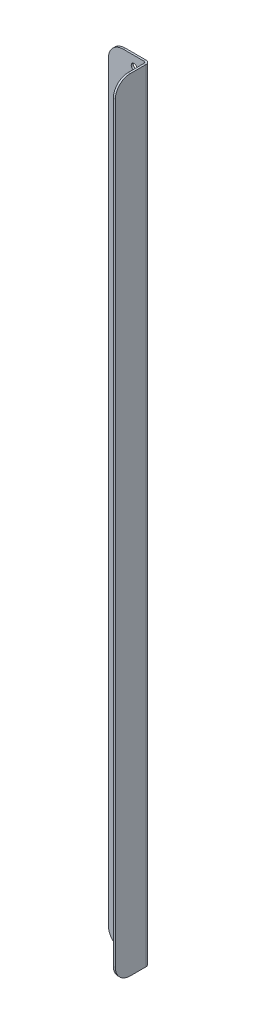
ISO-10303-21;
HEADER;
FILE_DESCRIPTION(('STEP AP214'),'2;1');
FILE_NAME('part.step','',(''),(''),'','','');
FILE_SCHEMA(('AUTOMOTIVE_DESIGN { 1 0 10303 214 1 1 1 1 }'));
ENDSEC;
DATA;
#1=APPLICATION_CONTEXT('core data for automotive mechanical design processes');
#2=APPLICATION_PROTOCOL_DEFINITION('international standard','automotive_design',2000,#1);
#3=PRODUCT_CONTEXT('',#1,'mechanical');
#4=PRODUCT('Part','Part','',(#3));
#5=PRODUCT_RELATED_PRODUCT_CATEGORY('part','',(#4));
#6=PRODUCT_DEFINITION_FORMATION('','',#4);
#7=PRODUCT_DEFINITION_CONTEXT('part definition',#1,'design');
#8=PRODUCT_DEFINITION('design','',#6,#7);
#9=PRODUCT_DEFINITION_SHAPE('','',#8);
#10=(LENGTH_UNIT() NAMED_UNIT(*) SI_UNIT(.MILLI.,.METRE.));
#11=(NAMED_UNIT(*) PLANE_ANGLE_UNIT() SI_UNIT($,.RADIAN.));
#12=(NAMED_UNIT(*) SI_UNIT($,.STERADIAN.) SOLID_ANGLE_UNIT());
#13=UNCERTAINTY_MEASURE_WITH_UNIT(LENGTH_MEASURE(1.E-05),#10,'distance_accuracy_value','');
#14=(GEOMETRIC_REPRESENTATION_CONTEXT(3) GLOBAL_UNCERTAINTY_ASSIGNED_CONTEXT((#13)) GLOBAL_UNIT_ASSIGNED_CONTEXT((#10,
#11,#12)) REPRESENTATION_CONTEXT('',''));
#15=CARTESIAN_POINT('',(0.,0.,0.));
#16=DIRECTION('',(0.,0.,1.));
#17=DIRECTION('',(1.,0.,0.));
#18=AXIS2_PLACEMENT_3D('',#15,#16,#17);
#19=CARTESIAN_POINT('',(6.00749999999836,386.,0.));
#20=DIRECTION('',(0.,0.,1.));
#21=DIRECTION('',(1.,0.,0.));
#22=AXIS2_PLACEMENT_3D('',#19,#20,#21);
#23=CYLINDRICAL_SURFACE('',#22,2.9);
#24=CARTESIAN_POINT('',(6.00749999999836,386.,-2.00000000000001));
#25=DIRECTION('',(0.,0.,1.));
#26=DIRECTION('',(1.,0.,0.));
#27=AXIS2_PLACEMENT_3D('',#24,#25,#26);
#28=CIRCLE('',#27,2.9);
#29=CARTESIAN_POINT('',(8.90749999999836,386.,-2.00000000000001));
#30=VERTEX_POINT('',#29);
#31=EDGE_CURVE('E278',#30,#30,#28,.T.);
#32=ORIENTED_EDGE('',*,*,#31,.F.);
#33=EDGE_LOOP('',(#32));
#34=FACE_BOUND('',#33,.T.);
#35=CARTESIAN_POINT('',(6.00749999999836,386.,0.));
#36=DIRECTION('',(0.,0.,1.));
#37=DIRECTION('',(1.,0.,0.));
#38=AXIS2_PLACEMENT_3D('',#35,#36,#37);
#39=CIRCLE('',#38,2.9);
#40=CARTESIAN_POINT('',(8.90749999999836,386.,0.));
#41=VERTEX_POINT('',#40);
#42=EDGE_CURVE('E282',#41,#41,#39,.T.);
#43=ORIENTED_EDGE('',*,*,#42,.T.);
#44=EDGE_LOOP('',(#43));
#45=FACE_BOUND('',#44,.T.);
#46=ADVANCED_FACE('F62',(#34,#45),#23,.F.);
#47=CARTESIAN_POINT('',(6.00749999999836,193.,0.));
#48=DIRECTION('',(0.,0.,1.));
#49=DIRECTION('',(1.,0.,0.));
#50=AXIS2_PLACEMENT_3D('',#47,#48,#49);
#51=CYLINDRICAL_SURFACE('',#50,2.9);
#52=CARTESIAN_POINT('',(6.00749999999836,193.,-2.00000000000001));
#53=DIRECTION('',(0.,0.,1.));
#54=DIRECTION('',(1.,0.,0.));
#55=AXIS2_PLACEMENT_3D('',#52,#53,#54);
#56=CIRCLE('',#55,2.9);
#57=CARTESIAN_POINT('',(8.90749999999836,193.,-2.00000000000001));
#58=VERTEX_POINT('',#57);
#59=EDGE_CURVE('E270',#58,#58,#56,.T.);
#60=ORIENTED_EDGE('',*,*,#59,.F.);
#61=EDGE_LOOP('',(#60));
#62=FACE_BOUND('',#61,.T.);
#63=CARTESIAN_POINT('',(6.00749999999836,193.,0.));
#64=DIRECTION('',(0.,0.,1.));
#65=DIRECTION('',(1.,0.,0.));
#66=AXIS2_PLACEMENT_3D('',#63,#64,#65);
#67=CIRCLE('',#66,2.9);
#68=CARTESIAN_POINT('',(8.90749999999836,193.,0.));
#69=VERTEX_POINT('',#68);
#70=EDGE_CURVE('E274',#69,#69,#67,.T.);
#71=ORIENTED_EDGE('',*,*,#70,.T.);
#72=EDGE_LOOP('',(#71));
#73=FACE_BOUND('',#72,.T.);
#74=ADVANCED_FACE('F422',(#62,#73),#51,.F.);
#75=CARTESIAN_POINT('',(6.00749999999836,0.,0.));
#76=DIRECTION('',(0.,0.,1.));
#77=DIRECTION('',(1.,0.,0.));
#78=AXIS2_PLACEMENT_3D('',#75,#76,#77);
#79=CYLINDRICAL_SURFACE('',#78,2.9);
#80=CARTESIAN_POINT('',(6.00749999999836,0.,-2.00000000000001));
#81=DIRECTION('',(0.,0.,1.));
#82=DIRECTION('',(1.,0.,0.));
#83=AXIS2_PLACEMENT_3D('',#80,#81,#82);
#84=CIRCLE('',#83,2.9);
#85=CARTESIAN_POINT('',(8.90749999999836,0.,-2.00000000000001));
#86=VERTEX_POINT('',#85);
#87=EDGE_CURVE('E253',#86,#86,#84,.T.);
#88=ORIENTED_EDGE('',*,*,#87,.F.);
#89=EDGE_LOOP('',(#88));
#90=FACE_BOUND('',#89,.T.);
#91=CARTESIAN_POINT('',(6.00749999999836,0.,0.));
#92=DIRECTION('',(0.,0.,1.));
#93=DIRECTION('',(1.,0.,0.));
#94=AXIS2_PLACEMENT_3D('',#91,#92,#93);
#95=CIRCLE('',#94,2.9);
#96=CARTESIAN_POINT('',(8.90749999999836,0.,0.));
#97=VERTEX_POINT('',#96);
#98=EDGE_CURVE('E266',#97,#97,#95,.T.);
#99=ORIENTED_EDGE('',*,*,#98,.T.);
#100=EDGE_LOOP('',(#99));
#101=FACE_BOUND('',#100,.T.);
#102=ADVANCED_FACE('F428',(#90,#101),#79,.F.);
#103=CARTESIAN_POINT('',(-20.,396.,-2.));
#104=DIRECTION('',(0.,1.,0.));
#105=DIRECTION('',(0.,0.,1.));
#106=AXIS2_PLACEMENT_3D('',#103,#104,#105);
#107=PLANE('',#106);
#108=DIRECTION('',(-1.,0.,0.));
#109=VECTOR('',#108,1.);
#110=CARTESIAN_POINT('',(-20.,396.,-2.));
#111=LINE('',#110,#109);
#112=CARTESIAN_POINT('',(16.,396.,-2.00000000000001));
#113=VERTEX_POINT('',#112);
#114=CARTESIAN_POINT('',(-5.,396.,-2.));
#115=VERTEX_POINT('',#114);
#116=EDGE_CURVE('E242',#113,#115,#111,.T.);
#117=ORIENTED_EDGE('',*,*,#116,.T.);
#118=DIRECTION('',(0.,0.,1.));
#119=VECTOR('',#118,1.);
#120=CARTESIAN_POINT('',(-5.,396.,-2.));
#121=LINE('',#120,#119);
#122=CARTESIAN_POINT('',(-5.,396.,0.));
#123=VERTEX_POINT('',#122);
#124=EDGE_CURVE('E307',#115,#123,#121,.T.);
#125=ORIENTED_EDGE('',*,*,#124,.T.);
#126=DIRECTION('',(-1.,0.,0.));
#127=VECTOR('',#126,1.);
#128=CARTESIAN_POINT('',(-20.,396.,0.));
#129=LINE('',#128,#127);
#130=CARTESIAN_POINT('',(16.,396.,0.));
#131=VERTEX_POINT('',#130);
#132=EDGE_CURVE('E239',#131,#123,#129,.T.);
#133=ORIENTED_EDGE('',*,*,#132,.F.);
#134=DIRECTION('',(0.,0.,-1.));
#135=VECTOR('',#134,1.);
#136=CARTESIAN_POINT('',(16.,396.,0.));
#137=LINE('',#136,#135);
#138=EDGE_CURVE('E224',#131,#113,#137,.T.);
#139=ORIENTED_EDGE('',*,*,#138,.T.);
#140=EDGE_LOOP('',(#117,#125,#133,#139));
#141=FACE_BOUND('',#140,.T.);
#142=ADVANCED_FACE('F374',(#141),#107,.T.);
#143=CARTESIAN_POINT('',(0.,0.,-2.));
#144=DIRECTION('',(0.,0.,-1.));
#145=DIRECTION('',(-1.,0.,0.));
#146=AXIS2_PLACEMENT_3D('',#143,#144,#145);
#147=PLANE('',#146);
#148=CARTESIAN_POINT('',(6.00749999999836,-193.,-2.00000000000001));
#149=DIRECTION('',(0.,0.,1.));
#150=DIRECTION('',(1.,0.,0.));
#151=AXIS2_PLACEMENT_3D('',#148,#149,#150);
#152=CIRCLE('',#151,2.9);
#153=CARTESIAN_POINT('',(8.90749999999836,-193.,-2.00000000000001));
#154=VERTEX_POINT('',#153);
#155=EDGE_CURVE('E695',#154,#154,#152,.T.);
#156=ORIENTED_EDGE('',*,*,#155,.T.);
#157=EDGE_LOOP('',(#156));
#158=FACE_BOUND('',#157,.T.);
#159=CARTESIAN_POINT('',(6.00749999999836,-386.,-2.00000000000001));
#160=DIRECTION('',(0.,0.,1.));
#161=DIRECTION('',(1.,0.,0.));
#162=AXIS2_PLACEMENT_3D('',#159,#160,#161);
#163=CIRCLE('',#162,2.9);
#164=CARTESIAN_POINT('',(8.90749999999836,-386.,-2.00000000000001));
#165=VERTEX_POINT('',#164);
#166=EDGE_CURVE('E219',#165,#165,#163,.T.);
#167=ORIENTED_EDGE('',*,*,#166,.T.);
#168=EDGE_LOOP('',(#167));
#169=FACE_BOUND('',#168,.T.);
#170=DIRECTION('',(0.,-1.,0.));
#171=VECTOR('',#170,1.);
#172=CARTESIAN_POINT('',(-20.,-396.,-2.));
#173=LINE('',#172,#171);
#174=CARTESIAN_POINT('',(-20.,381.,-2.));
#175=VERTEX_POINT('',#174);
#176=CARTESIAN_POINT('',(-20.,-381.,-2.));
#177=VERTEX_POINT('',#176);
#178=EDGE_CURVE('E246',#175,#177,#173,.T.);
#179=ORIENTED_EDGE('',*,*,#178,.F.);
#180=CARTESIAN_POINT('',(-5.,381.,-2.));
#181=DIRECTION('',(0.,0.,-1.));
#182=DIRECTION('',(-1.,0.,0.));
#183=AXIS2_PLACEMENT_3D('',#180,#181,#182);
#184=CIRCLE('',#183,15.);
#185=EDGE_CURVE('E326',#175,#115,#184,.T.);
#186=ORIENTED_EDGE('',*,*,#185,.T.);
#187=ORIENTED_EDGE('',*,*,#116,.F.);
#188=DIRECTION('',(0.,1.,0.));
#189=VECTOR('',#188,1.);
#190=CARTESIAN_POINT('',(16.,396.,-2.00000000000001));
#191=LINE('',#190,#189);
#192=CARTESIAN_POINT('',(16.,-396.,-2.));
#193=VERTEX_POINT('',#192);
#194=EDGE_CURVE('E161',#113,#193,#191,.F.);
#195=ORIENTED_EDGE('',*,*,#194,.T.);
#196=DIRECTION('',(1.,0.,0.));
#197=VECTOR('',#196,1.);
#198=CARTESIAN_POINT('',(-20.,-396.,-2.));
#199=LINE('',#198,#197);
#200=CARTESIAN_POINT('',(-5.,-396.,-2.));
#201=VERTEX_POINT('',#200);
#202=EDGE_CURVE('E250',#201,#193,#199,.T.);
#203=ORIENTED_EDGE('',*,*,#202,.F.);
#204=CARTESIAN_POINT('',(-5.,-381.,-2.));
#205=DIRECTION('',(0.,0.,-1.));
#206=DIRECTION('',(-1.,0.,0.));
#207=AXIS2_PLACEMENT_3D('',#204,#205,#206);
#208=CIRCLE('',#207,15.);
#209=EDGE_CURVE('E84',#201,#177,#208,.T.);
#210=ORIENTED_EDGE('',*,*,#209,.T.);
#211=EDGE_LOOP('',(#179,#186,#187,#195,#203,#210));
#212=FACE_BOUND('',#211,.T.);
#213=ORIENTED_EDGE('',*,*,#87,.T.);
#214=EDGE_LOOP('',(#213));
#215=FACE_BOUND('',#214,.T.);
#216=ORIENTED_EDGE('',*,*,#59,.T.);
#217=EDGE_LOOP('',(#216));
#218=FACE_BOUND('',#217,.T.);
#219=ORIENTED_EDGE('',*,*,#31,.T.);
#220=EDGE_LOOP('',(#219));
#221=FACE_BOUND('',#220,.T.);
#222=ADVANCED_FACE('F368',(#158,#169,#212,#215,#218,#221),#147,.T.);
#223=CARTESIAN_POINT('',(0.,0.,0.));
#224=DIRECTION('',(0.,0.,-1.));
#225=DIRECTION('',(-1.,0.,0.));
#226=AXIS2_PLACEMENT_3D('',#223,#224,#225);
#227=PLANE('',#226);
#228=CARTESIAN_POINT('',(6.00749999999836,-193.,0.));
#229=DIRECTION('',(0.,0.,1.));
#230=DIRECTION('',(1.,0.,0.));
#231=AXIS2_PLACEMENT_3D('',#228,#229,#230);
#232=CIRCLE('',#231,2.9);
#233=CARTESIAN_POINT('',(8.90749999999836,-193.,0.));
#234=VERTEX_POINT('',#233);
#235=EDGE_CURVE('E703',#234,#234,#232,.T.);
#236=ORIENTED_EDGE('',*,*,#235,.F.);
#237=EDGE_LOOP('',(#236));
#238=FACE_BOUND('',#237,.T.);
#239=CARTESIAN_POINT('',(6.00749999999836,-386.,0.));
#240=DIRECTION('',(0.,0.,1.));
#241=DIRECTION('',(1.,0.,0.));
#242=AXIS2_PLACEMENT_3D('',#239,#240,#241);
#243=CIRCLE('',#242,2.9);
#244=CARTESIAN_POINT('',(8.90749999999836,-386.,0.));
#245=VERTEX_POINT('',#244);
#246=EDGE_CURVE('E699',#245,#245,#243,.T.);
#247=ORIENTED_EDGE('',*,*,#246,.F.);
#248=EDGE_LOOP('',(#247));
#249=FACE_BOUND('',#248,.T.);
#250=ORIENTED_EDGE('',*,*,#132,.T.);
#251=CARTESIAN_POINT('',(-5.,381.,0.));
#252=DIRECTION('',(0.,0.,-1.));
#253=DIRECTION('',(-1.,0.,0.));
#254=AXIS2_PLACEMENT_3D('',#251,#252,#253);
#255=CIRCLE('',#254,15.);
#256=CARTESIAN_POINT('',(-20.,381.,0.));
#257=VERTEX_POINT('',#256);
#258=EDGE_CURVE('E314',#123,#257,#255,.F.);
#259=ORIENTED_EDGE('',*,*,#258,.T.);
#260=DIRECTION('',(0.,-1.,0.));
#261=VECTOR('',#260,1.);
#262=CARTESIAN_POINT('',(-20.,-396.,0.));
#263=LINE('',#262,#261);
#264=CARTESIAN_POINT('',(-20.,-381.,0.));
#265=VERTEX_POINT('',#264);
#266=EDGE_CURVE('E257',#257,#265,#263,.T.);
#267=ORIENTED_EDGE('',*,*,#266,.T.);
#268=CARTESIAN_POINT('',(-5.,-381.,0.));
#269=DIRECTION('',(0.,0.,-1.));
#270=DIRECTION('',(-1.,0.,0.));
#271=AXIS2_PLACEMENT_3D('',#268,#269,#270);
#272=CIRCLE('',#271,15.);
#273=CARTESIAN_POINT('',(-5.,-396.,0.));
#274=VERTEX_POINT('',#273);
#275=EDGE_CURVE('E311',#265,#274,#272,.F.);
#276=ORIENTED_EDGE('',*,*,#275,.T.);
#277=DIRECTION('',(1.,0.,0.));
#278=VECTOR('',#277,1.);
#279=CARTESIAN_POINT('',(-20.,-396.,0.));
#280=LINE('',#279,#278);
#281=CARTESIAN_POINT('',(16.,-396.,0.));
#282=VERTEX_POINT('',#281);
#283=EDGE_CURVE('E247',#274,#282,#280,.T.);
#284=ORIENTED_EDGE('',*,*,#283,.T.);
#285=DIRECTION('',(0.,1.,0.));
#286=VECTOR('',#285,1.);
#287=CARTESIAN_POINT('',(16.,396.,0.));
#288=LINE('',#287,#286);
#289=EDGE_CURVE('E229',#131,#282,#288,.F.);
#290=ORIENTED_EDGE('',*,*,#289,.F.);
#291=EDGE_LOOP('',(#250,#259,#267,#276,#284,#290));
#292=FACE_BOUND('',#291,.T.);
#293=ORIENTED_EDGE('',*,*,#98,.F.);
#294=EDGE_LOOP('',(#293));
#295=FACE_BOUND('',#294,.T.);
#296=ORIENTED_EDGE('',*,*,#70,.F.);
#297=EDGE_LOOP('',(#296));
#298=FACE_BOUND('',#297,.T.);
#299=ORIENTED_EDGE('',*,*,#42,.F.);
#300=EDGE_LOOP('',(#299));
#301=FACE_BOUND('',#300,.T.);
#302=ADVANCED_FACE('F379',(#238,#249,#292,#295,#298,#301),#227,.F.);
#303=CARTESIAN_POINT('',(-20.,-396.,-2.));
#304=DIRECTION('',(0.,-1.,0.));
#305=DIRECTION('',(0.,0.,-1.));
#306=AXIS2_PLACEMENT_3D('',#303,#304,#305);
#307=PLANE('',#306);
#308=ORIENTED_EDGE('',*,*,#283,.F.);
#309=DIRECTION('',(0.,0.,1.));
#310=VECTOR('',#309,1.);
#311=CARTESIAN_POINT('',(-5.,-396.,-2.));
#312=LINE('',#311,#310);
#313=EDGE_CURVE('E71',#274,#201,#312,.F.);
#314=ORIENTED_EDGE('',*,*,#313,.T.);
#315=ORIENTED_EDGE('',*,*,#202,.T.);
#316=DIRECTION('',(0.,0.,-1.));
#317=VECTOR('',#316,1.);
#318=CARTESIAN_POINT('',(16.,-396.,0.));
#319=LINE('',#318,#317);
#320=EDGE_CURVE('E235',#282,#193,#319,.T.);
#321=ORIENTED_EDGE('',*,*,#320,.F.);
#322=EDGE_LOOP('',(#308,#314,#315,#321));
#323=FACE_BOUND('',#322,.T.);
#324=ADVANCED_FACE('F388',(#323),#307,.T.);
#325=CARTESIAN_POINT('',(-20.,-396.,-2.));
#326=DIRECTION('',(-1.,0.,0.));
#327=DIRECTION('',(0.,0.,1.));
#328=AXIS2_PLACEMENT_3D('',#325,#326,#327);
#329=PLANE('',#328);
#330=ORIENTED_EDGE('',*,*,#266,.F.);
#331=DIRECTION('',(0.,0.,1.));
#332=VECTOR('',#331,1.);
#333=CARTESIAN_POINT('',(-20.,381.,-2.));
#334=LINE('',#333,#332);
#335=EDGE_CURVE('E321',#257,#175,#334,.F.);
#336=ORIENTED_EDGE('',*,*,#335,.T.);
#337=ORIENTED_EDGE('',*,*,#178,.T.);
#338=DIRECTION('',(0.,0.,1.));
#339=VECTOR('',#338,1.);
#340=CARTESIAN_POINT('',(-20.,-381.,-2.));
#341=LINE('',#340,#339);
#342=EDGE_CURVE('E317',#177,#265,#341,.T.);
#343=ORIENTED_EDGE('',*,*,#342,.T.);
#344=EDGE_LOOP('',(#330,#336,#337,#343));
#345=FACE_BOUND('',#344,.T.);
#346=ADVANCED_FACE('F383',(#345),#329,.T.);
#347=CARTESIAN_POINT('',(16.,-396.,1.99999999999999));
#348=DIRECTION('',(0.,-1.,0.));
#349=DIRECTION('',(0.,0.,-1.));
#350=AXIS2_PLACEMENT_3D('',#347,#348,#349);
#351=PLANE('',#350);
#352=DIRECTION('',(-1.,0.,0.));
#353=VECTOR('',#352,1.);
#354=CARTESIAN_POINT('',(20.,-396.,1.99999999999999));
#355=LINE('',#354,#353);
#356=CARTESIAN_POINT('',(18.,-396.,1.99999999999999));
#357=VERTEX_POINT('',#356);
#358=CARTESIAN_POINT('',(20.,-396.,1.99999999999998));
#359=VERTEX_POINT('',#358);
#360=EDGE_CURVE('E215',#357,#359,#355,.F.);
#361=ORIENTED_EDGE('',*,*,#360,.F.);
#362=CARTESIAN_POINT('',(16.,-396.,1.99999999999999));
#363=DIRECTION('',(0.,1.,0.));
#364=DIRECTION('',(0.,0.,1.));
#365=AXIS2_PLACEMENT_3D('',#362,#363,#364);
#366=CIRCLE('',#365,2.);
#367=EDGE_CURVE('E165',#282,#357,#366,.F.);
#368=ORIENTED_EDGE('',*,*,#367,.F.);
#369=ORIENTED_EDGE('',*,*,#320,.T.);
#370=CARTESIAN_POINT('',(16.,-396.,1.99999999999999));
#371=DIRECTION('',(0.,1.,0.));
#372=DIRECTION('',(0.,0.,1.));
#373=AXIS2_PLACEMENT_3D('',#370,#371,#372);
#374=CIRCLE('',#373,4.);
#375=EDGE_CURVE('E222',#193,#359,#374,.F.);
#376=ORIENTED_EDGE('',*,*,#375,.T.);
#377=EDGE_LOOP('',(#361,#368,#369,#376));
#378=FACE_BOUND('',#377,.T.);
#379=ADVANCED_FACE('F392',(#378),#351,.T.);
#380=CARTESIAN_POINT('',(16.,396.,1.99999999999999));
#381=DIRECTION('',(0.,-1.,0.));
#382=DIRECTION('',(0.,0.,-1.));
#383=AXIS2_PLACEMENT_3D('',#380,#381,#382);
#384=PLANE('',#383);
#385=CARTESIAN_POINT('',(16.,396.,1.99999999999999));
#386=DIRECTION('',(0.,1.,0.));
#387=DIRECTION('',(0.,0.,1.));
#388=AXIS2_PLACEMENT_3D('',#385,#386,#387);
#389=CIRCLE('',#388,2.);
#390=CARTESIAN_POINT('',(18.,396.,1.99999999999999));
#391=VERTEX_POINT('',#390);
#392=EDGE_CURVE('E172',#391,#131,#389,.T.);
#393=ORIENTED_EDGE('',*,*,#392,.F.);
#394=DIRECTION('',(-1.,0.,0.));
#395=VECTOR('',#394,1.);
#396=CARTESIAN_POINT('',(18.,396.,1.99999999999998));
#397=LINE('',#396,#395);
#398=CARTESIAN_POINT('',(20.,396.,1.99999999999997));
#399=VERTEX_POINT('',#398);
#400=EDGE_CURVE('E169',#391,#399,#397,.F.);
#401=ORIENTED_EDGE('',*,*,#400,.T.);
#402=CARTESIAN_POINT('',(16.,396.,1.99999999999999));
#403=DIRECTION('',(0.,1.,0.));
#404=DIRECTION('',(0.,0.,1.));
#405=AXIS2_PLACEMENT_3D('',#402,#403,#404);
#406=CIRCLE('',#405,4.);
#407=EDGE_CURVE('E153',#399,#113,#406,.T.);
#408=ORIENTED_EDGE('',*,*,#407,.T.);
#409=ORIENTED_EDGE('',*,*,#138,.F.);
#410=EDGE_LOOP('',(#393,#401,#408,#409));
#411=FACE_BOUND('',#410,.T.);
#412=ADVANCED_FACE('F170',(#411),#384,.F.);
#413=CARTESIAN_POINT('',(16.,396.,1.99999999999999));
#414=DIRECTION('',(0.,1.,0.));
#415=DIRECTION('',(1.,0.,0.));
#416=AXIS2_PLACEMENT_3D('',#413,#414,#415);
#417=CYLINDRICAL_SURFACE('',#416,4.);
#418=ORIENTED_EDGE('',*,*,#194,.F.);
#419=ORIENTED_EDGE('',*,*,#407,.F.);
#420=DIRECTION('',(0.,1.,0.));
#421=VECTOR('',#420,1.);
#422=CARTESIAN_POINT('',(20.,-396.,1.99999999999999));
#423=LINE('',#422,#421);
#424=EDGE_CURVE('E158',#399,#359,#423,.F.);
#425=ORIENTED_EDGE('',*,*,#424,.T.);
#426=ORIENTED_EDGE('',*,*,#375,.F.);
#427=EDGE_LOOP('',(#418,#419,#425,#426));
#428=FACE_BOUND('',#427,.T.);
#429=ADVANCED_FACE('F155',(#428),#417,.T.);
#430=CARTESIAN_POINT('',(16.,396.,1.99999999999999));
#431=DIRECTION('',(0.,1.,0.));
#432=DIRECTION('',(1.,0.,0.));
#433=AXIS2_PLACEMENT_3D('',#430,#431,#432);
#434=CYLINDRICAL_SURFACE('',#433,2.);
#435=ORIENTED_EDGE('',*,*,#289,.T.);
#436=ORIENTED_EDGE('',*,*,#367,.T.);
#437=DIRECTION('',(0.,1.,0.));
#438=VECTOR('',#437,1.);
#439=CARTESIAN_POINT('',(18.,-396.,1.99999999999999));
#440=LINE('',#439,#438);
#441=EDGE_CURVE('E178',#357,#391,#440,.T.);
#442=ORIENTED_EDGE('',*,*,#441,.T.);
#443=ORIENTED_EDGE('',*,*,#392,.T.);
#444=EDGE_LOOP('',(#435,#436,#442,#443));
#445=FACE_BOUND('',#444,.T.);
#446=ADVANCED_FACE('F395',(#445),#434,.F.);
#447=CARTESIAN_POINT('',(20.,-396.,0.));
#448=DIRECTION('',(0.,1.,0.));
#449=DIRECTION('',(0.,0.,1.));
#450=AXIS2_PLACEMENT_3D('',#447,#448,#449);
#451=PLANE('',#450);
#452=DIRECTION('',(0.,0.,-1.));
#453=VECTOR('',#452,1.);
#454=CARTESIAN_POINT('',(20.,-396.,0.));
#455=LINE('',#454,#453);
#456=CARTESIAN_POINT('',(20.0000000000001,-396.,18.));
#457=VERTEX_POINT('',#456);
#458=EDGE_CURVE('E186',#457,#359,#455,.T.);
#459=ORIENTED_EDGE('',*,*,#458,.F.);
#460=DIRECTION('',(-1.,0.,0.));
#461=VECTOR('',#460,1.);
#462=CARTESIAN_POINT('',(20.0000000000001,-396.,18.));
#463=LINE('',#462,#461);
#464=CARTESIAN_POINT('',(18.0000000000001,-396.,18.));
#465=VERTEX_POINT('',#464);
#466=EDGE_CURVE('E13',#457,#465,#463,.T.);
#467=ORIENTED_EDGE('',*,*,#466,.T.);
#468=DIRECTION('',(0.,0.,1.));
#469=VECTOR('',#468,1.);
#470=CARTESIAN_POINT('',(18.,-396.,0.));
#471=LINE('',#470,#469);
#472=EDGE_CURVE('E188',#465,#357,#471,.F.);
#473=ORIENTED_EDGE('',*,*,#472,.T.);
#474=ORIENTED_EDGE('',*,*,#360,.T.);
#475=EDGE_LOOP('',(#459,#467,#473,#474));
#476=FACE_BOUND('',#475,.T.);
#477=ADVANCED_FACE('F411',(#476),#451,.F.);
#478=CARTESIAN_POINT('',(20.0000000000001,396.,33.));
#479=DIRECTION('',(0.,-1.,0.));
#480=DIRECTION('',(0.,0.,-1.));
#481=AXIS2_PLACEMENT_3D('',#478,#479,#480);
#482=PLANE('',#481);
#483=DIRECTION('',(0.,0.,-1.));
#484=VECTOR('',#483,1.);
#485=CARTESIAN_POINT('',(18.0000000000001,396.,33.));
#486=LINE('',#485,#484);
#487=CARTESIAN_POINT('',(18.0000000000001,396.,18.));
#488=VERTEX_POINT('',#487);
#489=EDGE_CURVE('E208',#391,#488,#486,.F.);
#490=ORIENTED_EDGE('',*,*,#489,.T.);
#491=DIRECTION('',(-1.,0.,0.));
#492=VECTOR('',#491,1.);
#493=CARTESIAN_POINT('',(20.0000000000001,396.,18.));
#494=LINE('',#493,#492);
#495=CARTESIAN_POINT('',(20.0000000000001,396.,18.));
#496=VERTEX_POINT('',#495);
#497=EDGE_CURVE('E192',#488,#496,#494,.F.);
#498=ORIENTED_EDGE('',*,*,#497,.T.);
#499=DIRECTION('',(0.,0.,1.));
#500=VECTOR('',#499,1.);
#501=CARTESIAN_POINT('',(20.,396.,5.89761913058335E-13));
#502=LINE('',#501,#500);
#503=EDGE_CURVE('E183',#399,#496,#502,.T.);
#504=ORIENTED_EDGE('',*,*,#503,.F.);
#505=ORIENTED_EDGE('',*,*,#400,.F.);
#506=EDGE_LOOP('',(#490,#498,#504,#505));
#507=FACE_BOUND('',#506,.T.);
#508=ADVANCED_FACE('F190',(#507),#482,.F.);
#509=CARTESIAN_POINT('',(20.,0.,0.));
#510=DIRECTION('',(-1.,0.,0.));
#511=DIRECTION('',(0.,0.,1.));
#512=AXIS2_PLACEMENT_3D('',#509,#510,#511);
#513=PLANE('',#512);
#514=ORIENTED_EDGE('',*,*,#503,.T.);
#515=CARTESIAN_POINT('',(20.0000000000001,381.,18.));
#516=DIRECTION('',(-1.,0.,0.));
#517=DIRECTION('',(0.,0.,1.));
#518=AXIS2_PLACEMENT_3D('',#515,#516,#517);
#519=CIRCLE('',#518,15.);
#520=CARTESIAN_POINT('',(20.0000000000001,381.,33.));
#521=VERTEX_POINT('',#520);
#522=EDGE_CURVE('E304',#496,#521,#519,.F.);
#523=ORIENTED_EDGE('',*,*,#522,.T.);
#524=DIRECTION('',(0.,-1.,0.));
#525=VECTOR('',#524,1.);
#526=CARTESIAN_POINT('',(20.0000000000001,0.,33.));
#527=LINE('',#526,#525);
#528=CARTESIAN_POINT('',(20.0000000000001,-381.,33.));
#529=VERTEX_POINT('',#528);
#530=EDGE_CURVE('E194',#521,#529,#527,.T.);
#531=ORIENTED_EDGE('',*,*,#530,.T.);
#532=CARTESIAN_POINT('',(20.0000000000001,-381.,18.));
#533=DIRECTION('',(-1.,0.,0.));
#534=DIRECTION('',(0.,0.,1.));
#535=AXIS2_PLACEMENT_3D('',#532,#533,#534);
#536=CIRCLE('',#535,15.);
#537=EDGE_CURVE('E301',#529,#457,#536,.F.);
#538=ORIENTED_EDGE('',*,*,#537,.T.);
#539=ORIENTED_EDGE('',*,*,#458,.T.);
#540=ORIENTED_EDGE('',*,*,#424,.F.);
#541=EDGE_LOOP('',(#514,#523,#531,#538,#539,#540));
#542=FACE_BOUND('',#541,.T.);
#543=ADVANCED_FACE('F182',(#542),#513,.F.);
#544=CARTESIAN_POINT('',(18.,0.,0.));
#545=DIRECTION('',(-1.,0.,0.));
#546=DIRECTION('',(0.,0.,1.));
#547=AXIS2_PLACEMENT_3D('',#544,#545,#546);
#548=PLANE('',#547);
#549=DIRECTION('',(0.,1.,0.));
#550=VECTOR('',#549,1.);
#551=CARTESIAN_POINT('',(18.0000000000001,-396.,33.));
#552=LINE('',#551,#550);
#553=CARTESIAN_POINT('',(18.0000000000001,381.,33.));
#554=VERTEX_POINT('',#553);
#555=CARTESIAN_POINT('',(18.0000000000001,-381.,33.));
#556=VERTEX_POINT('',#555);
#557=EDGE_CURVE('E201',#554,#556,#552,.F.);
#558=ORIENTED_EDGE('',*,*,#557,.F.);
#559=CARTESIAN_POINT('',(18.0000000000001,381.,18.));
#560=DIRECTION('',(-1.,0.,0.));
#561=DIRECTION('',(0.,0.,1.));
#562=AXIS2_PLACEMENT_3D('',#559,#560,#561);
#563=CIRCLE('',#562,15.);
#564=EDGE_CURVE('E296',#554,#488,#563,.T.);
#565=ORIENTED_EDGE('',*,*,#564,.T.);
#566=ORIENTED_EDGE('',*,*,#489,.F.);
#567=ORIENTED_EDGE('',*,*,#441,.F.);
#568=ORIENTED_EDGE('',*,*,#472,.F.);
#569=CARTESIAN_POINT('',(18.0000000000001,-381.,18.));
#570=DIRECTION('',(-1.,0.,0.));
#571=DIRECTION('',(0.,0.,1.));
#572=AXIS2_PLACEMENT_3D('',#569,#570,#571);
#573=CIRCLE('',#572,15.);
#574=EDGE_CURVE('E293',#465,#556,#573,.T.);
#575=ORIENTED_EDGE('',*,*,#574,.T.);
#576=EDGE_LOOP('',(#558,#565,#566,#567,#568,#575));
#577=FACE_BOUND('',#576,.T.);
#578=ADVANCED_FACE('F399',(#577),#548,.T.);
#579=CARTESIAN_POINT('',(20.0000000000001,-396.,33.));
#580=DIRECTION('',(0.,0.,-1.));
#581=DIRECTION('',(-1.,0.,0.));
#582=AXIS2_PLACEMENT_3D('',#579,#580,#581);
#583=PLANE('',#582);
#584=ORIENTED_EDGE('',*,*,#530,.F.);
#585=DIRECTION('',(-1.,0.,0.));
#586=VECTOR('',#585,1.);
#587=CARTESIAN_POINT('',(20.0000000000001,381.,33.));
#588=LINE('',#587,#586);
#589=EDGE_CURVE('E289',#521,#554,#588,.T.);
#590=ORIENTED_EDGE('',*,*,#589,.T.);
#591=ORIENTED_EDGE('',*,*,#557,.T.);
#592=DIRECTION('',(-1.,0.,0.));
#593=VECTOR('',#592,1.);
#594=CARTESIAN_POINT('',(20.0000000000001,-381.,33.));
#595=LINE('',#594,#593);
#596=EDGE_CURVE('E286',#556,#529,#595,.F.);
#597=ORIENTED_EDGE('',*,*,#596,.T.);
#598=EDGE_LOOP('',(#584,#590,#591,#597));
#599=FACE_BOUND('',#598,.T.);
#600=ADVANCED_FACE('F406',(#599),#583,.F.);
#601=CARTESIAN_POINT('',(6.00749999999836,-386.,0.));
#602=DIRECTION('',(0.,0.,1.));
#603=DIRECTION('',(1.,0.,0.));
#604=AXIS2_PLACEMENT_3D('',#601,#602,#603);
#605=CYLINDRICAL_SURFACE('',#604,2.9);
#606=ORIENTED_EDGE('',*,*,#166,.F.);
#607=EDGE_LOOP('',(#606));
#608=FACE_BOUND('',#607,.T.);
#609=ORIENTED_EDGE('',*,*,#246,.T.);
#610=EDGE_LOOP('',(#609));
#611=FACE_BOUND('',#610,.T.);
#612=ADVANCED_FACE('F471',(#608,#611),#605,.F.);
#613=CARTESIAN_POINT('',(6.00749999999836,-193.,0.));
#614=DIRECTION('',(0.,0.,1.));
#615=DIRECTION('',(1.,0.,0.));
#616=AXIS2_PLACEMENT_3D('',#613,#614,#615);
#617=CYLINDRICAL_SURFACE('',#616,2.9);
#618=ORIENTED_EDGE('',*,*,#155,.F.);
#619=EDGE_LOOP('',(#618));
#620=FACE_BOUND('',#619,.T.);
#621=ORIENTED_EDGE('',*,*,#235,.T.);
#622=EDGE_LOOP('',(#621));
#623=FACE_BOUND('',#622,.T.);
#624=ADVANCED_FACE('F437',(#620,#623),#617,.F.);
#625=CARTESIAN_POINT('',(20.0000000000001,381.,18.));
#626=DIRECTION('',(-1.,0.,0.));
#627=DIRECTION('',(0.,0.,1.));
#628=AXIS2_PLACEMENT_3D('',#625,#626,#627);
#629=CYLINDRICAL_SURFACE('',#628,15.);
#630=ORIENTED_EDGE('',*,*,#522,.F.);
#631=ORIENTED_EDGE('',*,*,#497,.F.);
#632=ORIENTED_EDGE('',*,*,#564,.F.);
#633=ORIENTED_EDGE('',*,*,#589,.F.);
#634=EDGE_LOOP('',(#630,#631,#632,#633));
#635=FACE_BOUND('',#634,.T.);
#636=ADVANCED_FACE('F401',(#635),#629,.T.);
#637=CARTESIAN_POINT('',(-5.,381.,-2.));
#638=DIRECTION('',(0.,0.,1.));
#639=DIRECTION('',(1.,0.,0.));
#640=AXIS2_PLACEMENT_3D('',#637,#638,#639);
#641=CYLINDRICAL_SURFACE('',#640,15.);
#642=ORIENTED_EDGE('',*,*,#185,.F.);
#643=ORIENTED_EDGE('',*,*,#335,.F.);
#644=ORIENTED_EDGE('',*,*,#258,.F.);
#645=ORIENTED_EDGE('',*,*,#124,.F.);
#646=EDGE_LOOP('',(#642,#643,#644,#645));
#647=FACE_BOUND('',#646,.T.);
#648=ADVANCED_FACE('F376',(#647),#641,.T.);
#649=CARTESIAN_POINT('',(-5.,-381.,-2.));
#650=DIRECTION('',(0.,0.,1.));
#651=DIRECTION('',(1.,0.,0.));
#652=AXIS2_PLACEMENT_3D('',#649,#650,#651);
#653=CYLINDRICAL_SURFACE('',#652,15.);
#654=ORIENTED_EDGE('',*,*,#209,.F.);
#655=ORIENTED_EDGE('',*,*,#313,.F.);
#656=ORIENTED_EDGE('',*,*,#275,.F.);
#657=ORIENTED_EDGE('',*,*,#342,.F.);
#658=EDGE_LOOP('',(#654,#655,#656,#657));
#659=FACE_BOUND('',#658,.T.);
#660=ADVANCED_FACE('F386',(#659),#653,.T.);
#661=CARTESIAN_POINT('',(20.0000000000001,-381.,18.));
#662=DIRECTION('',(-1.,0.,0.));
#663=DIRECTION('',(0.,0.,1.));
#664=AXIS2_PLACEMENT_3D('',#661,#662,#663);
#665=CYLINDRICAL_SURFACE('',#664,15.);
#666=ORIENTED_EDGE('',*,*,#537,.F.);
#667=ORIENTED_EDGE('',*,*,#596,.F.);
#668=ORIENTED_EDGE('',*,*,#574,.F.);
#669=ORIENTED_EDGE('',*,*,#466,.F.);
#670=EDGE_LOOP('',(#666,#667,#668,#669));
#671=FACE_BOUND('',#670,.T.);
#672=ADVANCED_FACE('F64',(#671),#665,.T.);
#673=CLOSED_SHELL('',(#46,#74,#102,#142,#222,#302,#324,#346,#379,#412,#429,#446,#477,#508,#543,
#578,#600,#612,#624,#636,#648,#660,#672));
#674=MANIFOLD_SOLID_BREP('B2',#673);
#675=ADVANCED_BREP_SHAPE_REPRESENTATION('',(#18,#674),#14);
#676=SHAPE_DEFINITION_REPRESENTATION(#9,#675);
ENDSEC;
END-ISO-10303-21;
